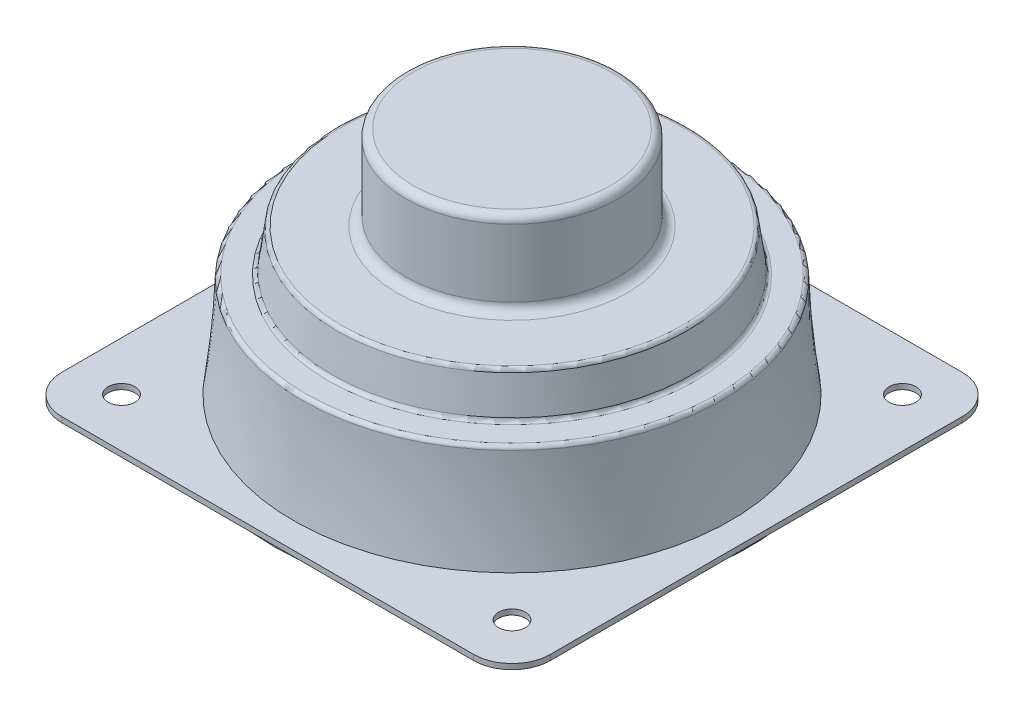
ISO-10303-21;
HEADER;
FILE_DESCRIPTION(('STEP AP214'),'2;1');
FILE_NAME('part.step','',(''),(''),'','','');
FILE_SCHEMA(('AUTOMOTIVE_DESIGN { 1 0 10303 214 1 1 1 1 }'));
ENDSEC;
DATA;
#1=APPLICATION_CONTEXT('core data for automotive mechanical design processes');
#2=APPLICATION_PROTOCOL_DEFINITION('international standard','automotive_design',2000,#1);
#3=PRODUCT_CONTEXT('',#1,'mechanical');
#4=PRODUCT('Part','Part','',(#3));
#5=PRODUCT_RELATED_PRODUCT_CATEGORY('part','',(#4));
#6=PRODUCT_DEFINITION_FORMATION('','',#4);
#7=PRODUCT_DEFINITION_CONTEXT('part definition',#1,'design');
#8=PRODUCT_DEFINITION('design','',#6,#7);
#9=PRODUCT_DEFINITION_SHAPE('','',#8);
#10=(LENGTH_UNIT() NAMED_UNIT(*) SI_UNIT(.MILLI.,.METRE.));
#11=(NAMED_UNIT(*) PLANE_ANGLE_UNIT() SI_UNIT($,.RADIAN.));
#12=(NAMED_UNIT(*) SI_UNIT($,.STERADIAN.) SOLID_ANGLE_UNIT());
#13=UNCERTAINTY_MEASURE_WITH_UNIT(LENGTH_MEASURE(1.E-05),#10,'distance_accuracy_value','');
#14=(GEOMETRIC_REPRESENTATION_CONTEXT(3) GLOBAL_UNCERTAINTY_ASSIGNED_CONTEXT((#13)) GLOBAL_UNIT_ASSIGNED_CONTEXT((#10,
#11,#12)) REPRESENTATION_CONTEXT('',''));
#15=CARTESIAN_POINT('',(0.,0.,0.));
#16=DIRECTION('',(0.,0.,1.));
#17=DIRECTION('',(1.,0.,0.));
#18=AXIS2_PLACEMENT_3D('',#15,#16,#17);
#19=CARTESIAN_POINT('',(0.,19.7,0.));
#20=DIRECTION('',(0.,1.,0.));
#21=DIRECTION('',(0.,0.,1.));
#22=AXIS2_PLACEMENT_3D('',#19,#20,#21);
#23=PLANE('',#22);
#24=CARTESIAN_POINT('',(0.,19.7,0.));
#25=DIRECTION('',(0.,1.,0.));
#26=DIRECTION('',(0.,0.,1.));
#27=AXIS2_PLACEMENT_3D('',#24,#25,#26);
#28=CIRCLE('',#27,22.3135544702006);
#29=CARTESIAN_POINT('',(0.,19.7,22.3135544702006));
#30=VERTEX_POINT('',#29);
#31=EDGE_CURVE('E12',#30,#30,#28,.T.);
#32=ORIENTED_EDGE('',*,*,#31,.T.);
#33=EDGE_LOOP('',(#32));
#34=FACE_BOUND('',#33,.T.);
#35=CARTESIAN_POINT('',(0.,19.7,0.));
#36=DIRECTION('',(0.,1.,0.));
#37=DIRECTION('',(0.,0.,1.));
#38=AXIS2_PLACEMENT_3D('',#35,#36,#37);
#39=CIRCLE('',#38,15.05);
#40=CARTESIAN_POINT('',(0.,19.7,15.05));
#41=VERTEX_POINT('',#40);
#42=EDGE_CURVE('E177',#41,#41,#39,.F.);
#43=ORIENTED_EDGE('',*,*,#42,.T.);
#44=EDGE_LOOP('',(#43));
#45=FACE_BOUND('',#44,.T.);
#46=ADVANCED_FACE('F39',(#34,#45),#23,.T.);
#47=CARTESIAN_POINT('',(0.,14.2,0.));
#48=DIRECTION('',(0.,1.,0.));
#49=DIRECTION('',(0.,0.,1.));
#50=AXIS2_PLACEMENT_3D('',#47,#48,#49);
#51=PLANE('',#50);
#52=CARTESIAN_POINT('',(0.,14.2,0.));
#53=DIRECTION('',(0.,1.,0.));
#54=DIRECTION('',(0.,0.,1.));
#55=AXIS2_PLACEMENT_3D('',#52,#53,#54);
#56=CIRCLE('',#55,26.8641485849492);
#57=CARTESIAN_POINT('',(0.,14.2,26.8641485849492));
#58=VERTEX_POINT('',#57);
#59=EDGE_CURVE('E183',#58,#58,#56,.T.);
#60=ORIENTED_EDGE('',*,*,#59,.T.);
#61=EDGE_LOOP('',(#60));
#62=FACE_BOUND('',#61,.T.);
#63=CARTESIAN_POINT('',(0.,14.2,0.));
#64=DIRECTION('',(0.,1.,0.));
#65=DIRECTION('',(0.,0.,1.));
#66=AXIS2_PLACEMENT_3D('',#63,#64,#65);
#67=CIRCLE('',#66,23.9364455297994);
#68=CARTESIAN_POINT('',(0.,14.2,23.9364455297994));
#69=VERTEX_POINT('',#68);
#70=EDGE_CURVE('E180',#69,#69,#67,.F.);
#71=ORIENTED_EDGE('',*,*,#70,.T.);
#72=EDGE_LOOP('',(#71));
#73=FACE_BOUND('',#72,.T.);
#74=ADVANCED_FACE('F211',(#62,#73),#51,.T.);
#75=CARTESIAN_POINT('',(0.,-1.,0.));
#76=DIRECTION('',(0.,-1.,0.));
#77=DIRECTION('',(0.,0.,-1.));
#78=AXIS2_PLACEMENT_3D('',#75,#76,#77);
#79=PLANE('',#78);
#80=CARTESIAN_POINT('',(0.,-1.,0.));
#81=DIRECTION('',(0.,-1.,0.));
#82=DIRECTION('',(0.,0.,-1.));
#83=AXIS2_PLACEMENT_3D('',#80,#81,#82);
#84=CIRCLE('',#83,31.);
#85=CARTESIAN_POINT('',(0.,-1.,-31.));
#86=VERTEX_POINT('',#85);
#87=EDGE_CURVE('E528',#86,#86,#84,.T.);
#88=ORIENTED_EDGE('',*,*,#87,.T.);
#89=EDGE_LOOP('',(#88));
#90=FACE_BOUND('',#89,.T.);
#91=CARTESIAN_POINT('',(0.,-1.,0.));
#92=DIRECTION('',(0.,-1.,0.));
#93=DIRECTION('',(0.,0.,-1.));
#94=AXIS2_PLACEMENT_3D('',#91,#92,#93);
#95=CIRCLE('',#94,25.2);
#96=CARTESIAN_POINT('',(0.,-1.,-25.2));
#97=VERTEX_POINT('',#96);
#98=EDGE_CURVE('E537',#97,#97,#95,.T.);
#99=ORIENTED_EDGE('',*,*,#98,.F.);
#100=EDGE_LOOP('',(#99));
#101=FACE_BOUND('',#100,.T.);
#102=ADVANCED_FACE('F217',(#90,#101),#79,.T.);
#103=CARTESIAN_POINT('',(-26.85,0.,26.85));
#104=DIRECTION('',(0.,-1.,0.));
#105=DIRECTION('',(0.,0.,-1.));
#106=AXIS2_PLACEMENT_3D('',#103,#104,#105);
#107=PLANE('',#106);
#108=CARTESIAN_POINT('',(-25.4558441227157,0.,25.4558441227157));
#109=DIRECTION('',(0.,1.,0.));
#110=DIRECTION('',(0.,0.,1.));
#111=AXIS2_PLACEMENT_3D('',#108,#109,#110);
#112=CIRCLE('',#111,1.75);
#113=CARTESIAN_POINT('',(-25.4558441227157,0.,27.2058441227157));
#114=VERTEX_POINT('',#113);
#115=EDGE_CURVE('E525',#114,#114,#112,.T.);
#116=ORIENTED_EDGE('',*,*,#115,.T.);
#117=EDGE_LOOP('',(#116));
#118=FACE_BOUND('',#117,.T.);
#119=CARTESIAN_POINT('',(25.4558441227157,0.,25.4558441227157));
#120=DIRECTION('',(0.,1.,0.));
#121=DIRECTION('',(0.,0.,1.));
#122=AXIS2_PLACEMENT_3D('',#119,#120,#121);
#123=CIRCLE('',#122,1.75);
#124=CARTESIAN_POINT('',(25.4558441227157,0.,27.2058441227157));
#125=VERTEX_POINT('',#124);
#126=EDGE_CURVE('E513',#125,#125,#123,.T.);
#127=ORIENTED_EDGE('',*,*,#126,.T.);
#128=EDGE_LOOP('',(#127));
#129=FACE_BOUND('',#128,.T.);
#130=CARTESIAN_POINT('',(-26.85,0.,26.85));
#131=DIRECTION('',(0.,1.,0.));
#132=DIRECTION('',(0.,0.,-1.));
#133=AXIS2_PLACEMENT_3D('',#130,#131,#132);
#134=CIRCLE('',#133,5.);
#135=CARTESIAN_POINT('',(-31.85,0.,26.85));
#136=VERTEX_POINT('',#135);
#137=CARTESIAN_POINT('',(-26.85,0.,31.85));
#138=VERTEX_POINT('',#137);
#139=EDGE_CURVE('E138',#136,#138,#134,.T.);
#140=ORIENTED_EDGE('',*,*,#139,.F.);
#141=DIRECTION('',(0.,0.,1.));
#142=VECTOR('',#141,1.);
#143=CARTESIAN_POINT('',(-31.85,0.,26.85));
#144=LINE('',#143,#142);
#145=CARTESIAN_POINT('',(-31.85,0.,-26.85));
#146=VERTEX_POINT('',#145);
#147=EDGE_CURVE('E91',#146,#136,#144,.T.);
#148=ORIENTED_EDGE('',*,*,#147,.F.);
#149=CARTESIAN_POINT('',(-26.85,0.,-26.85));
#150=DIRECTION('',(0.,1.,0.));
#151=DIRECTION('',(0.,0.,1.));
#152=AXIS2_PLACEMENT_3D('',#149,#150,#151);
#153=CIRCLE('',#152,5.);
#154=CARTESIAN_POINT('',(-26.85,0.,-31.85));
#155=VERTEX_POINT('',#154);
#156=EDGE_CURVE('E85',#155,#146,#153,.T.);
#157=ORIENTED_EDGE('',*,*,#156,.F.);
#158=DIRECTION('',(-1.,0.,0.));
#159=VECTOR('',#158,1.);
#160=CARTESIAN_POINT('',(26.85,0.,-31.85));
#161=LINE('',#160,#159);
#162=CARTESIAN_POINT('',(26.85,0.,-31.85));
#163=VERTEX_POINT('',#162);
#164=EDGE_CURVE('E128',#163,#155,#161,.T.);
#165=ORIENTED_EDGE('',*,*,#164,.F.);
#166=CARTESIAN_POINT('',(26.85,0.,-26.85));
#167=DIRECTION('',(0.,1.,0.));
#168=DIRECTION('',(0.,0.,1.));
#169=AXIS2_PLACEMENT_3D('',#166,#167,#168);
#170=CIRCLE('',#169,5.);
#171=CARTESIAN_POINT('',(31.85,0.,-26.85));
#172=VERTEX_POINT('',#171);
#173=EDGE_CURVE('E148',#172,#163,#170,.T.);
#174=ORIENTED_EDGE('',*,*,#173,.F.);
#175=DIRECTION('',(0.,0.,-1.));
#176=VECTOR('',#175,1.);
#177=CARTESIAN_POINT('',(31.85,0.,26.85));
#178=LINE('',#177,#176);
#179=CARTESIAN_POINT('',(31.85,0.,26.85));
#180=VERTEX_POINT('',#179);
#181=EDGE_CURVE('E146',#180,#172,#178,.T.);
#182=ORIENTED_EDGE('',*,*,#181,.F.);
#183=CARTESIAN_POINT('',(26.85,0.,26.85));
#184=DIRECTION('',(0.,1.,0.));
#185=DIRECTION('',(0.,0.,1.));
#186=AXIS2_PLACEMENT_3D('',#183,#184,#185);
#187=CIRCLE('',#186,5.);
#188=CARTESIAN_POINT('',(26.85,0.,31.85));
#189=VERTEX_POINT('',#188);
#190=EDGE_CURVE('E144',#189,#180,#187,.T.);
#191=ORIENTED_EDGE('',*,*,#190,.F.);
#192=DIRECTION('',(1.,0.,0.));
#193=VECTOR('',#192,1.);
#194=CARTESIAN_POINT('',(26.85,0.,31.85));
#195=LINE('',#194,#193);
#196=EDGE_CURVE('E141',#138,#189,#195,.T.);
#197=ORIENTED_EDGE('',*,*,#196,.F.);
#198=EDGE_LOOP('',(#140,#148,#157,#165,#174,#182,#191,#197));
#199=FACE_BOUND('',#198,.T.);
#200=CARTESIAN_POINT('',(-25.4558441227157,0.,-25.4558441227157));
#201=DIRECTION('',(0.,1.,0.));
#202=DIRECTION('',(0.,0.,1.));
#203=AXIS2_PLACEMENT_3D('',#200,#201,#202);
#204=CIRCLE('',#203,1.75);
#205=CARTESIAN_POINT('',(-25.4558441227157,0.,-23.7058441227157));
#206=VERTEX_POINT('',#205);
#207=EDGE_CURVE('E507',#206,#206,#204,.T.);
#208=ORIENTED_EDGE('',*,*,#207,.T.);
#209=EDGE_LOOP('',(#208));
#210=FACE_BOUND('',#209,.T.);
#211=CARTESIAN_POINT('',(25.4558441227157,0.,-25.4558441227157));
#212=DIRECTION('',(0.,1.,0.));
#213=DIRECTION('',(0.,0.,1.));
#214=AXIS2_PLACEMENT_3D('',#211,#212,#213);
#215=CIRCLE('',#214,1.75);
#216=CARTESIAN_POINT('',(25.4558441227157,0.,-23.7058441227157));
#217=VERTEX_POINT('',#216);
#218=EDGE_CURVE('E519',#217,#217,#215,.T.);
#219=ORIENTED_EDGE('',*,*,#218,.T.);
#220=EDGE_LOOP('',(#219));
#221=FACE_BOUND('',#220,.T.);
#222=CARTESIAN_POINT('',(0.,0.,0.));
#223=DIRECTION('',(0.,-1.,0.));
#224=DIRECTION('',(0.,0.,-1.));
#225=AXIS2_PLACEMENT_3D('',#222,#223,#224);
#226=CIRCLE('',#225,31.);
#227=CARTESIAN_POINT('',(0.,0.,-31.));
#228=VERTEX_POINT('',#227);
#229=EDGE_CURVE('E531',#228,#228,#226,.T.);
#230=ORIENTED_EDGE('',*,*,#229,.F.);
#231=EDGE_LOOP('',(#230));
#232=FACE_BOUND('',#231,.T.);
#233=ADVANCED_FACE('F246',(#118,#129,#199,#210,#221,#232),#107,.T.);
#234=CARTESIAN_POINT('',(-26.85,0.7,26.85));
#235=DIRECTION('',(0.,-1.,0.));
#236=DIRECTION('',(0.,0.,-1.));
#237=AXIS2_PLACEMENT_3D('',#234,#235,#236);
#238=PLANE('',#237);
#239=CARTESIAN_POINT('',(0.,0.7,0.));
#240=DIRECTION('',(0.,1.,0.));
#241=DIRECTION('',(0.,0.,1.));
#242=AXIS2_PLACEMENT_3D('',#239,#240,#241);
#243=CIRCLE('',#242,28.5);
#244=CARTESIAN_POINT('',(-9.77187594911808,0.7,26.7723820463374));
#245=VERTEX_POINT('',#244);
#246=EDGE_CURVE('E540',#245,#245,#243,.T.);
#247=ORIENTED_EDGE('',*,*,#246,.F.);
#248=EDGE_LOOP('',(#247));
#249=FACE_BOUND('',#248,.T.);
#250=CARTESIAN_POINT('',(25.4558441227157,0.7,-25.4558441227157));
#251=DIRECTION('',(0.,1.,0.));
#252=DIRECTION('',(0.,0.,1.));
#253=AXIS2_PLACEMENT_3D('',#250,#251,#252);
#254=CIRCLE('',#253,1.75);
#255=CARTESIAN_POINT('',(25.4558441227157,0.7,-23.7058441227157));
#256=VERTEX_POINT('',#255);
#257=EDGE_CURVE('E516',#256,#256,#254,.T.);
#258=ORIENTED_EDGE('',*,*,#257,.F.);
#259=EDGE_LOOP('',(#258));
#260=FACE_BOUND('',#259,.T.);
#261=CARTESIAN_POINT('',(-25.4558441227157,0.7,-25.4558441227157));
#262=DIRECTION('',(0.,1.,0.));
#263=DIRECTION('',(0.,0.,1.));
#264=AXIS2_PLACEMENT_3D('',#261,#262,#263);
#265=CIRCLE('',#264,1.75);
#266=CARTESIAN_POINT('',(-25.4558441227157,0.7,-23.7058441227157));
#267=VERTEX_POINT('',#266);
#268=EDGE_CURVE('E142',#267,#267,#265,.T.);
#269=ORIENTED_EDGE('',*,*,#268,.F.);
#270=EDGE_LOOP('',(#269));
#271=FACE_BOUND('',#270,.T.);
#272=CARTESIAN_POINT('',(-26.85,0.7,26.85));
#273=DIRECTION('',(0.,1.,0.));
#274=DIRECTION('',(0.,0.,-1.));
#275=AXIS2_PLACEMENT_3D('',#272,#273,#274);
#276=CIRCLE('',#275,5.);
#277=CARTESIAN_POINT('',(-31.85,0.7,26.85));
#278=VERTEX_POINT('',#277);
#279=CARTESIAN_POINT('',(-26.85,0.7,31.85));
#280=VERTEX_POINT('',#279);
#281=EDGE_CURVE('E153',#278,#280,#276,.T.);
#282=ORIENTED_EDGE('',*,*,#281,.T.);
#283=DIRECTION('',(1.,0.,0.));
#284=VECTOR('',#283,1.);
#285=CARTESIAN_POINT('',(26.85,0.7,31.85));
#286=LINE('',#285,#284);
#287=CARTESIAN_POINT('',(26.85,0.7,31.85));
#288=VERTEX_POINT('',#287);
#289=EDGE_CURVE('E100',#280,#288,#286,.T.);
#290=ORIENTED_EDGE('',*,*,#289,.T.);
#291=CARTESIAN_POINT('',(26.85,0.7,26.85));
#292=DIRECTION('',(0.,1.,0.));
#293=DIRECTION('',(0.,0.,1.));
#294=AXIS2_PLACEMENT_3D('',#291,#292,#293);
#295=CIRCLE('',#294,5.);
#296=CARTESIAN_POINT('',(31.85,0.7,26.85));
#297=VERTEX_POINT('',#296);
#298=EDGE_CURVE('E499',#288,#297,#295,.T.);
#299=ORIENTED_EDGE('',*,*,#298,.T.);
#300=DIRECTION('',(0.,0.,-1.));
#301=VECTOR('',#300,1.);
#302=CARTESIAN_POINT('',(31.85,0.7,26.85));
#303=LINE('',#302,#301);
#304=CARTESIAN_POINT('',(31.85,0.7,-26.85));
#305=VERTEX_POINT('',#304);
#306=EDGE_CURVE('E501',#297,#305,#303,.T.);
#307=ORIENTED_EDGE('',*,*,#306,.T.);
#308=CARTESIAN_POINT('',(26.85,0.7,-26.85));
#309=DIRECTION('',(0.,1.,0.));
#310=DIRECTION('',(0.,0.,1.));
#311=AXIS2_PLACEMENT_3D('',#308,#309,#310);
#312=CIRCLE('',#311,5.);
#313=CARTESIAN_POINT('',(26.85,0.7,-31.85));
#314=VERTEX_POINT('',#313);
#315=EDGE_CURVE('E120',#305,#314,#312,.T.);
#316=ORIENTED_EDGE('',*,*,#315,.T.);
#317=DIRECTION('',(-1.,0.,0.));
#318=VECTOR('',#317,1.);
#319=CARTESIAN_POINT('',(26.85,0.7,-31.85));
#320=LINE('',#319,#318);
#321=CARTESIAN_POINT('',(-26.85,0.7,-31.85));
#322=VERTEX_POINT('',#321);
#323=EDGE_CURVE('E113',#314,#322,#320,.T.);
#324=ORIENTED_EDGE('',*,*,#323,.T.);
#325=CARTESIAN_POINT('',(-26.85,0.7,-26.85));
#326=DIRECTION('',(0.,1.,0.));
#327=DIRECTION('',(0.,0.,1.));
#328=AXIS2_PLACEMENT_3D('',#325,#326,#327);
#329=CIRCLE('',#328,5.);
#330=CARTESIAN_POINT('',(-31.85,0.7,-26.85));
#331=VERTEX_POINT('',#330);
#332=EDGE_CURVE('E118',#322,#331,#329,.T.);
#333=ORIENTED_EDGE('',*,*,#332,.T.);
#334=DIRECTION('',(0.,0.,1.));
#335=VECTOR('',#334,1.);
#336=CARTESIAN_POINT('',(-31.85,0.7,26.85));
#337=LINE('',#336,#335);
#338=EDGE_CURVE('E56',#331,#278,#337,.T.);
#339=ORIENTED_EDGE('',*,*,#338,.T.);
#340=EDGE_LOOP('',(#282,#290,#299,#307,#316,#324,#333,#339));
#341=FACE_BOUND('',#340,.T.);
#342=CARTESIAN_POINT('',(25.4558441227157,0.7,25.4558441227157));
#343=DIRECTION('',(0.,1.,0.));
#344=DIRECTION('',(0.,0.,1.));
#345=AXIS2_PLACEMENT_3D('',#342,#343,#344);
#346=CIRCLE('',#345,1.75);
#347=CARTESIAN_POINT('',(25.4558441227157,0.7,27.2058441227157));
#348=VERTEX_POINT('',#347);
#349=EDGE_CURVE('E510',#348,#348,#346,.T.);
#350=ORIENTED_EDGE('',*,*,#349,.F.);
#351=EDGE_LOOP('',(#350));
#352=FACE_BOUND('',#351,.T.);
#353=CARTESIAN_POINT('',(-25.4558441227157,0.7,25.4558441227157));
#354=DIRECTION('',(0.,1.,0.));
#355=DIRECTION('',(0.,0.,1.));
#356=AXIS2_PLACEMENT_3D('',#353,#354,#355);
#357=CIRCLE('',#356,1.75);
#358=CARTESIAN_POINT('',(-25.4558441227157,0.7,27.2058441227157));
#359=VERTEX_POINT('',#358);
#360=EDGE_CURVE('E522',#359,#359,#357,.T.);
#361=ORIENTED_EDGE('',*,*,#360,.F.);
#362=EDGE_LOOP('',(#361));
#363=FACE_BOUND('',#362,.T.);
#364=ADVANCED_FACE('F115',(#249,#260,#271,#341,#352,#363),#238,.F.);
#365=CARTESIAN_POINT('',(-26.85,0.7,26.85));
#366=DIRECTION('',(0.,-1.,0.));
#367=DIRECTION('',(0.,0.,-1.));
#368=AXIS2_PLACEMENT_3D('',#365,#366,#367);
#369=CYLINDRICAL_SURFACE('',#368,5.);
#370=ORIENTED_EDGE('',*,*,#139,.T.);
#371=DIRECTION('',(0.,-1.,0.));
#372=VECTOR('',#371,1.);
#373=CARTESIAN_POINT('',(-26.85,0.7,31.85));
#374=LINE('',#373,#372);
#375=EDGE_CURVE('E166',#280,#138,#374,.T.);
#376=ORIENTED_EDGE('',*,*,#375,.F.);
#377=ORIENTED_EDGE('',*,*,#281,.F.);
#378=DIRECTION('',(0.,-1.,0.));
#379=VECTOR('',#378,1.);
#380=CARTESIAN_POINT('',(-31.85,0.7,26.85));
#381=LINE('',#380,#379);
#382=EDGE_CURVE('E134',#278,#136,#381,.T.);
#383=ORIENTED_EDGE('',*,*,#382,.T.);
#384=EDGE_LOOP('',(#370,#376,#377,#383));
#385=FACE_BOUND('',#384,.T.);
#386=ADVANCED_FACE('F270',(#385),#369,.T.);
#387=CARTESIAN_POINT('',(26.85,0.7,31.85));
#388=DIRECTION('',(0.,0.,-1.));
#389=DIRECTION('',(-1.,0.,0.));
#390=AXIS2_PLACEMENT_3D('',#387,#388,#389);
#391=PLANE('',#390);
#392=ORIENTED_EDGE('',*,*,#196,.T.);
#393=DIRECTION('',(0.,-1.,0.));
#394=VECTOR('',#393,1.);
#395=CARTESIAN_POINT('',(26.85,0.7,31.85));
#396=LINE('',#395,#394);
#397=EDGE_CURVE('E163',#288,#189,#396,.T.);
#398=ORIENTED_EDGE('',*,*,#397,.F.);
#399=ORIENTED_EDGE('',*,*,#289,.F.);
#400=ORIENTED_EDGE('',*,*,#375,.T.);
#401=EDGE_LOOP('',(#392,#398,#399,#400));
#402=FACE_BOUND('',#401,.T.);
#403=ADVANCED_FACE('F292',(#402),#391,.F.);
#404=CARTESIAN_POINT('',(26.85,0.7,26.85));
#405=DIRECTION('',(0.,-1.,0.));
#406=DIRECTION('',(0.,0.,-1.));
#407=AXIS2_PLACEMENT_3D('',#404,#405,#406);
#408=CYLINDRICAL_SURFACE('',#407,5.);
#409=ORIENTED_EDGE('',*,*,#190,.T.);
#410=DIRECTION('',(0.,-1.,0.));
#411=VECTOR('',#410,1.);
#412=CARTESIAN_POINT('',(31.85,0.7,26.85));
#413=LINE('',#412,#411);
#414=EDGE_CURVE('E160',#297,#180,#413,.T.);
#415=ORIENTED_EDGE('',*,*,#414,.F.);
#416=ORIENTED_EDGE('',*,*,#298,.F.);
#417=ORIENTED_EDGE('',*,*,#397,.T.);
#418=EDGE_LOOP('',(#409,#415,#416,#417));
#419=FACE_BOUND('',#418,.T.);
#420=ADVANCED_FACE('F288',(#419),#408,.T.);
#421=CARTESIAN_POINT('',(31.85,0.7,26.85));
#422=DIRECTION('',(-1.,0.,0.));
#423=DIRECTION('',(0.,0.,1.));
#424=AXIS2_PLACEMENT_3D('',#421,#422,#423);
#425=PLANE('',#424);
#426=ORIENTED_EDGE('',*,*,#181,.T.);
#427=DIRECTION('',(0.,-1.,0.));
#428=VECTOR('',#427,1.);
#429=CARTESIAN_POINT('',(31.85,0.7,-26.85));
#430=LINE('',#429,#428);
#431=EDGE_CURVE('E157',#305,#172,#430,.T.);
#432=ORIENTED_EDGE('',*,*,#431,.F.);
#433=ORIENTED_EDGE('',*,*,#306,.F.);
#434=ORIENTED_EDGE('',*,*,#414,.T.);
#435=EDGE_LOOP('',(#426,#432,#433,#434));
#436=FACE_BOUND('',#435,.T.);
#437=ADVANCED_FACE('F284',(#436),#425,.F.);
#438=CARTESIAN_POINT('',(26.85,0.7,-26.85));
#439=DIRECTION('',(0.,-1.,0.));
#440=DIRECTION('',(0.,0.,-1.));
#441=AXIS2_PLACEMENT_3D('',#438,#439,#440);
#442=CYLINDRICAL_SURFACE('',#441,5.);
#443=ORIENTED_EDGE('',*,*,#173,.T.);
#444=DIRECTION('',(0.,-1.,0.));
#445=VECTOR('',#444,1.);
#446=CARTESIAN_POINT('',(26.85,0.7,-31.85));
#447=LINE('',#446,#445);
#448=EDGE_CURVE('E129',#314,#163,#447,.T.);
#449=ORIENTED_EDGE('',*,*,#448,.F.);
#450=ORIENTED_EDGE('',*,*,#315,.F.);
#451=ORIENTED_EDGE('',*,*,#431,.T.);
#452=EDGE_LOOP('',(#443,#449,#450,#451));
#453=FACE_BOUND('',#452,.T.);
#454=ADVANCED_FACE('F281',(#453),#442,.T.);
#455=CARTESIAN_POINT('',(26.85,0.7,-31.85));
#456=DIRECTION('',(0.,0.,1.));
#457=DIRECTION('',(1.,0.,0.));
#458=AXIS2_PLACEMENT_3D('',#455,#456,#457);
#459=PLANE('',#458);
#460=ORIENTED_EDGE('',*,*,#164,.T.);
#461=DIRECTION('',(0.,-1.,0.));
#462=VECTOR('',#461,1.);
#463=CARTESIAN_POINT('',(-26.85,0.7,-31.85));
#464=LINE('',#463,#462);
#465=EDGE_CURVE('E125',#322,#155,#464,.T.);
#466=ORIENTED_EDGE('',*,*,#465,.F.);
#467=ORIENTED_EDGE('',*,*,#323,.F.);
#468=ORIENTED_EDGE('',*,*,#448,.T.);
#469=EDGE_LOOP('',(#460,#466,#467,#468));
#470=FACE_BOUND('',#469,.T.);
#471=ADVANCED_FACE('F126',(#470),#459,.F.);
#472=CARTESIAN_POINT('',(-26.85,0.7,-26.85));
#473=DIRECTION('',(0.,-1.,0.));
#474=DIRECTION('',(0.,0.,-1.));
#475=AXIS2_PLACEMENT_3D('',#472,#473,#474);
#476=CYLINDRICAL_SURFACE('',#475,5.);
#477=ORIENTED_EDGE('',*,*,#156,.T.);
#478=DIRECTION('',(0.,-1.,0.));
#479=VECTOR('',#478,1.);
#480=CARTESIAN_POINT('',(-31.85,0.7,-26.85));
#481=LINE('',#480,#479);
#482=EDGE_CURVE('E130',#331,#146,#481,.T.);
#483=ORIENTED_EDGE('',*,*,#482,.F.);
#484=ORIENTED_EDGE('',*,*,#332,.F.);
#485=ORIENTED_EDGE('',*,*,#465,.T.);
#486=EDGE_LOOP('',(#477,#483,#484,#485));
#487=FACE_BOUND('',#486,.T.);
#488=ADVANCED_FACE('F132',(#487),#476,.T.);
#489=CARTESIAN_POINT('',(-31.85,0.7,26.85));
#490=DIRECTION('',(1.,0.,0.));
#491=DIRECTION('',(0.,0.,-1.));
#492=AXIS2_PLACEMENT_3D('',#489,#490,#491);
#493=PLANE('',#492);
#494=ORIENTED_EDGE('',*,*,#147,.T.);
#495=ORIENTED_EDGE('',*,*,#382,.F.);
#496=ORIENTED_EDGE('',*,*,#338,.F.);
#497=ORIENTED_EDGE('',*,*,#482,.T.);
#498=EDGE_LOOP('',(#494,#495,#496,#497));
#499=FACE_BOUND('',#498,.T.);
#500=ADVANCED_FACE('F266',(#499),#493,.F.);
#501=CARTESIAN_POINT('',(-25.4558441227157,0.7,-25.4558441227157));
#502=DIRECTION('',(0.,-1.,0.));
#503=DIRECTION('',(0.,0.,-1.));
#504=AXIS2_PLACEMENT_3D('',#501,#502,#503);
#505=CYLINDRICAL_SURFACE('',#504,1.75);
#506=ORIENTED_EDGE('',*,*,#268,.T.);
#507=EDGE_LOOP('',(#506));
#508=FACE_BOUND('',#507,.T.);
#509=ORIENTED_EDGE('',*,*,#207,.F.);
#510=EDGE_LOOP('',(#509));
#511=FACE_BOUND('',#510,.T.);
#512=ADVANCED_FACE('F262',(#508,#511),#505,.F.);
#513=CARTESIAN_POINT('',(25.4558441227157,0.7,25.4558441227157));
#514=DIRECTION('',(0.,-1.,0.));
#515=DIRECTION('',(0.,0.,-1.));
#516=AXIS2_PLACEMENT_3D('',#513,#514,#515);
#517=CYLINDRICAL_SURFACE('',#516,1.75);
#518=ORIENTED_EDGE('',*,*,#349,.T.);
#519=EDGE_LOOP('',(#518));
#520=FACE_BOUND('',#519,.T.);
#521=ORIENTED_EDGE('',*,*,#126,.F.);
#522=EDGE_LOOP('',(#521));
#523=FACE_BOUND('',#522,.T.);
#524=ADVANCED_FACE('F258',(#520,#523),#517,.F.);
#525=CARTESIAN_POINT('',(25.4558441227157,0.7,-25.4558441227157));
#526=DIRECTION('',(0.,-1.,0.));
#527=DIRECTION('',(0.,0.,-1.));
#528=AXIS2_PLACEMENT_3D('',#525,#526,#527);
#529=CYLINDRICAL_SURFACE('',#528,1.75);
#530=ORIENTED_EDGE('',*,*,#257,.T.);
#531=EDGE_LOOP('',(#530));
#532=FACE_BOUND('',#531,.T.);
#533=ORIENTED_EDGE('',*,*,#218,.F.);
#534=EDGE_LOOP('',(#533));
#535=FACE_BOUND('',#534,.T.);
#536=ADVANCED_FACE('F254',(#532,#535),#529,.F.);
#537=CARTESIAN_POINT('',(-25.4558441227157,0.7,25.4558441227157));
#538=DIRECTION('',(0.,-1.,0.));
#539=DIRECTION('',(0.,0.,-1.));
#540=AXIS2_PLACEMENT_3D('',#537,#538,#539);
#541=CYLINDRICAL_SURFACE('',#540,1.75);
#542=ORIENTED_EDGE('',*,*,#360,.T.);
#543=EDGE_LOOP('',(#542));
#544=FACE_BOUND('',#543,.T.);
#545=ORIENTED_EDGE('',*,*,#115,.F.);
#546=EDGE_LOOP('',(#545));
#547=FACE_BOUND('',#546,.T.);
#548=ADVANCED_FACE('F250',(#544,#547),#541,.F.);
#549=CARTESIAN_POINT('',(0.,-1.,0.));
#550=DIRECTION('',(0.,1.,0.));
#551=DIRECTION('',(0.,0.,1.));
#552=AXIS2_PLACEMENT_3D('',#549,#550,#551);
#553=CYLINDRICAL_SURFACE('',#552,31.);
#554=ORIENTED_EDGE('',*,*,#87,.F.);
#555=EDGE_LOOP('',(#554));
#556=FACE_BOUND('',#555,.T.);
#557=ORIENTED_EDGE('',*,*,#229,.T.);
#558=EDGE_LOOP('',(#557));
#559=FACE_BOUND('',#558,.T.);
#560=ADVANCED_FACE('F242',(#556,#559),#553,.T.);
#561=CARTESIAN_POINT('',(0.,-3.,0.));
#562=DIRECTION('',(0.,1.,0.));
#563=DIRECTION('',(0.,0.,1.));
#564=AXIS2_PLACEMENT_3D('',#561,#562,#563);
#565=CYLINDRICAL_SURFACE('',#564,25.2);
#566=CARTESIAN_POINT('',(0.,-3.,0.));
#567=DIRECTION('',(0.,-1.,0.));
#568=DIRECTION('',(0.,0.,-1.));
#569=AXIS2_PLACEMENT_3D('',#566,#567,#568);
#570=CIRCLE('',#569,25.2);
#571=CARTESIAN_POINT('',(0.,-3.,-25.2));
#572=VERTEX_POINT('',#571);
#573=EDGE_CURVE('E534',#572,#572,#570,.T.);
#574=ORIENTED_EDGE('',*,*,#573,.F.);
#575=EDGE_LOOP('',(#574));
#576=FACE_BOUND('',#575,.T.);
#577=ORIENTED_EDGE('',*,*,#98,.T.);
#578=EDGE_LOOP('',(#577));
#579=FACE_BOUND('',#578,.T.);
#580=ADVANCED_FACE('F238',(#576,#579),#565,.T.);
#581=CARTESIAN_POINT('',(0.,-3.,0.));
#582=DIRECTION('',(0.,-1.,0.));
#583=DIRECTION('',(0.,0.,-1.));
#584=AXIS2_PLACEMENT_3D('',#581,#582,#583);
#585=PLANE('',#584);
#586=ORIENTED_EDGE('',*,*,#573,.T.);
#587=EDGE_LOOP('',(#586));
#588=FACE_BOUND('',#587,.T.);
#589=ADVANCED_FACE('F228',(#588),#585,.T.);
#590=CARTESIAN_POINT('',(-9.77187594911808,0.7,26.7723820463374));
#591=CARTESIAN_POINT('',(-3.10369624119678,14.2,27.1733245967876));
#592=CARTESIAN_POINT('',(43.7728881435567,0.7,46.3161339445735));
#593=CARTESIAN_POINT('',(51.2429529523783,14.2,33.3807170791811));
#594=CARTESIAN_POINT('',(63.3166400417928,0.7,-7.22863014810123));
#595=CARTESIAN_POINT('',(57.4503454347719,14.2,-20.965932114394));
#596=CARTESIAN_POINT('',(9.77187594911807,0.7,-26.7723820463374));
#597=CARTESIAN_POINT('',(3.1036962411968,14.2,-27.1733245967876));
#598=CARTESIAN_POINT('',(-43.7728881435567,0.7,-46.3161339445735));
#599=CARTESIAN_POINT('',(-51.2429529523784,14.2,-33.3807170791812));
#600=CARTESIAN_POINT('',(-63.3166400417928,0.7,7.22863014810123));
#601=CARTESIAN_POINT('',(-57.450345434772,14.2,20.965932114394));
#602=CARTESIAN_POINT('',(-9.77187594911808,0.7,26.7723820463374));
#603=CARTESIAN_POINT('',(-3.10369624119678,14.2,27.1733245967876));
#604=(BOUNDED_SURFACE() B_SPLINE_SURFACE(3,1,((#590,#591),(#592,#593),(#594,#595),(#596,#597),
(#598,#599),(#600,#601),(#602,#603)),.UNSPECIFIED.,.T.,.F.,.F.) B_SPLINE_SURFACE_WITH_KNOTS((4,
3,4),(2,2),(0.,0.5,1.),(0.,1.),
.UNSPECIFIED.) GEOMETRIC_REPRESENTATION_ITEM() RATIONAL_B_SPLINE_SURFACE(((1.,1.),
(0.333333333333333,0.333333333333334),(0.333333333333333,0.333333333333334),(1.,1.),
(0.333333333333333,0.333333333333333),(0.333333333333333,0.333333333333333),(1.,1.))) REPRESENTATION_ITEM('') SURFACE());
#605=CARTESIAN_POINT('',(0.,13.7154264177727,0.));
#606=DIRECTION('',(0.,1.,0.));
#607=DIRECTION('',(0.,0.,1.));
#608=AXIS2_PLACEMENT_3D('',#605,#606,#607);
#609=CIRCLE('',#608,27.3639105539252);
#610=CARTESIAN_POINT('',(-3.34304614697479,13.7154264177727,27.1589330287921));
#611=VERTEX_POINT('',#610);
#612=EDGE_CURVE('E186',#611,#611,#609,.F.);
#613=CARTESIAN_POINT('',(-3.34304614697479,13.7154264177727,27.1589330287921));
#614=CARTESIAN_POINT('',(-3.41001312408045,13.5798490592542,27.1549064560582));
#615=CARTESIAN_POINT('',(-3.47698010118611,13.4442717007357,27.1508798833243));
#616=CARTESIAN_POINT('',(-3.61091405539743,13.1731169836988,27.1428267378565));
#617=CARTESIAN_POINT('',(-3.67788103250309,13.0375396251803,27.1388001651226));
#618=CARTESIAN_POINT('',(-3.81181498671441,12.7663849081434,27.1307470196548));
#619=CARTESIAN_POINT('',(-3.87878196382006,12.6308075496249,27.1267204469209));
#620=CARTESIAN_POINT('',(-4.01271591803138,12.359652832588,27.1186673014531));
#621=CARTESIAN_POINT('',(-4.07968289513704,12.2240754740695,27.1146407287192));
#622=CARTESIAN_POINT('',(-4.21361684934836,11.9529207570326,27.1065875832514));
#623=CARTESIAN_POINT('',(-4.28058382645402,11.8173433985141,27.1025610105175));
#624=CARTESIAN_POINT('',(-4.41451778066534,11.5461886814772,27.0945078650496));
#625=CARTESIAN_POINT('',(-4.481484757771,11.4106113229587,27.0904812923157));
#626=CARTESIAN_POINT('',(-4.61541871198232,11.1394566059218,27.0824281468479));
#627=CARTESIAN_POINT('',(-4.68238568908798,11.0038792474034,27.078401574114));
#628=CARTESIAN_POINT('',(-4.81631964329929,10.7327245303664,27.0703484286462));
#629=CARTESIAN_POINT('',(-4.88328662040495,10.597147171848,27.0663218559123));
#630=CARTESIAN_POINT('',(-5.01722057461627,10.325992454811,27.0582687104445));
#631=CARTESIAN_POINT('',(-5.08418755172193,10.1904150962926,27.0542421377106));
#632=CARTESIAN_POINT('',(-5.21812150593325,9.91926037925563,27.0461889922428));
#633=CARTESIAN_POINT('',(-5.28508848303891,9.78368302073716,27.0421624195089));
#634=CARTESIAN_POINT('',(-5.41902243725023,9.51252830370024,27.0341092740411));
#635=CARTESIAN_POINT('',(-5.48598941435589,9.37695094518177,27.0300827013072));
#636=CARTESIAN_POINT('',(-5.6199233685672,9.10579622814484,27.0220295558394));
#637=CARTESIAN_POINT('',(-5.68689034567286,8.97021886962638,27.0180029831055));
#638=CARTESIAN_POINT('',(-5.82082429988418,8.69906415258944,27.0099498376377));
#639=CARTESIAN_POINT('',(-5.88779127698984,8.56348679407098,27.0059232649038));
#640=CARTESIAN_POINT('',(-6.02172523120116,8.29233207703405,26.997870119436));
#641=CARTESIAN_POINT('',(-6.08869220830682,8.15675471851558,26.9938435467021));
#642=CARTESIAN_POINT('',(-6.22262616251814,7.88560000147865,26.9857904012343));
#643=CARTESIAN_POINT('',(-6.2895931396238,7.75002264296019,26.9817638285004));
#644=CARTESIAN_POINT('',(-6.42352709383511,7.47886792592326,26.9737106830325));
#645=CARTESIAN_POINT('',(-6.49049407094077,7.34329056740479,26.9696841102986));
#646=CARTESIAN_POINT('',(-6.62442802515209,7.07213585036786,26.9616309648308));
#647=CARTESIAN_POINT('',(-6.69139500225775,6.9365584918494,26.9576043920969));
#648=CARTESIAN_POINT('',(-6.82532895646907,6.66540377481247,26.9495512466291));
#649=CARTESIAN_POINT('',(-6.89229593357473,6.529826416294,26.9455246738952));
#650=CARTESIAN_POINT('',(-7.02622988778605,6.25867169925707,26.9374715284274));
#651=CARTESIAN_POINT('',(-7.09319686489171,6.12309434073861,26.9334449556935));
#652=CARTESIAN_POINT('',(-7.22713081910303,5.85193962370168,26.9253918102257));
#653=CARTESIAN_POINT('',(-7.29409779620868,5.71636226518321,26.9213652374918));
#654=CARTESIAN_POINT('',(-7.42803175042,5.44520754814628,26.913312092024));
#655=CARTESIAN_POINT('',(-7.49499872752566,5.30963018962782,26.9092855192901));
#656=CARTESIAN_POINT('',(-7.62893268173698,5.03847547259088,26.9012323738223));
#657=CARTESIAN_POINT('',(-7.69589965884264,4.90289811407242,26.8972058010884));
#658=CARTESIAN_POINT('',(-7.82983361305396,4.63174339703549,26.8891526556206));
#659=CARTESIAN_POINT('',(-7.89680059015962,4.49616603851702,26.8851260828867));
#660=CARTESIAN_POINT('',(-8.03073454437094,4.2250113214801,26.8770729374189));
#661=CARTESIAN_POINT('',(-8.0977015214766,4.08943396296163,26.873046364685));
#662=CARTESIAN_POINT('',(-8.23163547568791,3.8182792459247,26.8649932192172));
#663=CARTESIAN_POINT('',(-8.29860245279357,3.68270188740623,26.8609666464832));
#664=CARTESIAN_POINT('',(-8.43253640700489,3.4115471703693,26.8529135010154));
#665=CARTESIAN_POINT('',(-8.49950338411055,3.27596981185084,26.8488869282815));
#666=CARTESIAN_POINT('',(-8.63343733832187,3.00481509481391,26.8408337828137));
#667=CARTESIAN_POINT('',(-8.70040431542753,2.86923773629544,26.8368072100798));
#668=CARTESIAN_POINT('',(-8.83433826963885,2.59808301925851,26.828754064612));
#669=CARTESIAN_POINT('',(-8.90130524674451,2.46250566074005,26.8247274918781));
#670=CARTESIAN_POINT('',(-9.03523920095583,2.19135094370312,26.8166743464103));
#671=CARTESIAN_POINT('',(-9.10220617806148,2.05577358518465,26.8126477736764));
#672=CARTESIAN_POINT('',(-9.2361401322728,1.78461886814772,26.8045946282086));
#673=CARTESIAN_POINT('',(-9.30310710937846,1.64904150962926,26.8005680554747));
#674=CARTESIAN_POINT('',(-9.43704106358978,1.37788679259233,26.7925149100069));
#675=CARTESIAN_POINT('',(-9.50400804069544,1.24230943407386,26.788488337273));
#676=CARTESIAN_POINT('',(-9.63794199490676,0.971154717036931,26.7804351918052));
#677=CARTESIAN_POINT('',(-9.70490897201242,0.835577358518465,26.7764086190713));
#678=CARTESIAN_POINT('',(-9.77187594911808,0.7,26.7723820463374));
#679=B_SPLINE_CURVE_WITH_KNOTS('',3,(#613,#614,#615,#616,#617,#618,#619,#620,#621,#622,#623,
#624,#625,#626,#627,#628,#629,#630,#631,#632,#633,#634,#635,#636,#637,#638,#639,#640,#641,#642,
#643,#644,#645,#646,#647,#648,#649,#650,#651,#652,#653,#654,#655,#656,#657,#658,#659,#660,#661,
#662,#663,#664,#665,#666,#667,#668,#669,#670,#671,#672,#673,#674,#675,#676,#677,#678),
.UNSPECIFIED.,.F.,.F.,(4,2,2,2,2,2,2,2,2,2,2,2,2,2,2,2,2,2,2,2,2,2,2,2,2,2,2,2,2,2,2,2,4),(0.,
0.453804016158365,0.90760803231673,1.36141204847509,1.81521606463346,2.26902008079182,
2.72282409695019,3.17662811310855,3.63043212926692,4.08423614542528,4.53804016158365,
4.99184417774201,5.44564819390038,5.89945221005875,6.35325622621711,6.80706024237548,
7.26086425853384,7.71466827469221,8.16847229085057,8.62227630700893,9.0760803231673,
9.52988433932567,9.98368835548403,10.4374923716424,10.8912963878008,11.3451004039591,
11.7989044201175,12.2527084362759,12.7065124524342,13.1603164685926,13.614120484751,
14.0679245009093,14.5217285170677),.UNSPECIFIED.);
#680=EDGE_CURVE('BSEAM224',#611,#245,#679,.T.);
#681=ORIENTED_EDGE('',*,*,#612,.T.);
#682=ORIENTED_EDGE('',*,*,#246,.T.);
#683=ORIENTED_EDGE('',*,*,#680,.T.);
#684=ORIENTED_EDGE('',*,*,#680,.F.);
#685=EDGE_LOOP('',(#681,#683,#682,#684));
#686=FACE_BOUND('',#685,.T.);
#687=ADVANCED_FACE('F224',(#686),#604,.T.);
#688=CARTESIAN_POINT('',(0.,19.7,0.));
#689=DIRECTION('',(0.,-1.,0.));
#690=DIRECTION('',(0.,0.,-1.));
#691=AXIS2_PLACEMENT_3D('',#688,#689,#690);
#692=CONICAL_SURFACE('',#691,22.75,0.135527713985501);
#693=CARTESIAN_POINT('',(0.,14.6324433976333,0.));
#694=DIRECTION('',(0.,-1.,0.));
#695=DIRECTION('',(0.,0.,-1.));
#696=AXIS2_PLACEMENT_3D('',#693,#694,#695);
#697=CIRCLE('',#696,23.4410304457773);
#698=CARTESIAN_POINT('',(0.,14.6324433976333,-23.4410304457773));
#699=VERTEX_POINT('',#698);
#700=EDGE_CURVE('E48',#699,#699,#697,.F.);
#701=ORIENTED_EDGE('',*,*,#700,.T.);
#702=EDGE_LOOP('',(#701));
#703=FACE_BOUND('',#702,.T.);
#704=CARTESIAN_POINT('',(0.,19.2675566023666,0.));
#705=DIRECTION('',(0.,1.,0.));
#706=DIRECTION('',(0.,0.,1.));
#707=AXIS2_PLACEMENT_3D('',#704,#705,#706);
#708=CIRCLE('',#707,22.8089695542227);
#709=CARTESIAN_POINT('',(0.,19.2675566023666,22.8089695542227));
#710=VERTEX_POINT('',#709);
#711=EDGE_CURVE('E189',#710,#710,#708,.F.);
#712=ORIENTED_EDGE('',*,*,#711,.T.);
#713=EDGE_LOOP('',(#712));
#714=FACE_BOUND('',#713,.T.);
#715=ADVANCED_FACE('F194',(#703,#714),#692,.T.);
#716=CARTESIAN_POINT('',(0.,30.7,0.));
#717=DIRECTION('',(0.,-1.,0.));
#718=DIRECTION('',(0.,0.,-1.));
#719=AXIS2_PLACEMENT_3D('',#716,#717,#718);
#720=CYLINDRICAL_SURFACE('',#719,13.85);
#721=CARTESIAN_POINT('',(0.,20.9,0.));
#722=DIRECTION('',(0.,1.,0.));
#723=DIRECTION('',(0.,0.,1.));
#724=AXIS2_PLACEMENT_3D('',#721,#722,#723);
#725=CIRCLE('',#724,13.85);
#726=CARTESIAN_POINT('',(0.,20.9,13.85));
#727=VERTEX_POINT('',#726);
#728=EDGE_CURVE('E174',#727,#727,#725,.T.);
#729=ORIENTED_EDGE('',*,*,#728,.T.);
#730=EDGE_LOOP('',(#729));
#731=FACE_BOUND('',#730,.T.);
#732=CARTESIAN_POINT('',(0.,29.7,0.));
#733=DIRECTION('',(0.,1.,0.));
#734=DIRECTION('',(0.,0.,1.));
#735=AXIS2_PLACEMENT_3D('',#732,#733,#734);
#736=CIRCLE('',#735,13.85);
#737=CARTESIAN_POINT('',(0.,29.7,13.85));
#738=VERTEX_POINT('',#737);
#739=EDGE_CURVE('E171',#738,#738,#736,.F.);
#740=ORIENTED_EDGE('',*,*,#739,.T.);
#741=EDGE_LOOP('',(#740));
#742=FACE_BOUND('',#741,.T.);
#743=ADVANCED_FACE('F312',(#731,#742),#720,.T.);
#744=CARTESIAN_POINT('',(0.,30.7,0.));
#745=DIRECTION('',(0.,1.,0.));
#746=DIRECTION('',(0.,0.,1.));
#747=AXIS2_PLACEMENT_3D('',#744,#745,#746);
#748=PLANE('',#747);
#749=CARTESIAN_POINT('',(0.,30.7,0.));
#750=DIRECTION('',(0.,1.,0.));
#751=DIRECTION('',(0.,0.,1.));
#752=AXIS2_PLACEMENT_3D('',#749,#750,#751);
#753=CIRCLE('',#752,12.85);
#754=CARTESIAN_POINT('',(0.,30.7,12.85));
#755=VERTEX_POINT('',#754);
#756=EDGE_CURVE('E168',#755,#755,#753,.T.);
#757=ORIENTED_EDGE('',*,*,#756,.T.);
#758=EDGE_LOOP('',(#757));
#759=FACE_BOUND('',#758,.T.);
#760=ADVANCED_FACE('F302',(#759),#748,.T.);
#761=CARTESIAN_POINT('',(0.,29.7,0.));
#762=DIRECTION('',(0.,1.,0.));
#763=DIRECTION('',(0.,0.,1.));
#764=AXIS2_PLACEMENT_3D('',#761,#762,#763);
#765=TOROIDAL_SURFACE('',#764,12.85,1.);
#766=ORIENTED_EDGE('',*,*,#739,.F.);
#767=EDGE_LOOP('',(#766));
#768=FACE_BOUND('',#767,.T.);
#769=ORIENTED_EDGE('',*,*,#756,.F.);
#770=EDGE_LOOP('',(#769));
#771=FACE_BOUND('',#770,.T.);
#772=ADVANCED_FACE('F299',(#768,#771),#765,.T.);
#773=CARTESIAN_POINT('',(0.,20.9,0.));
#774=DIRECTION('',(0.,1.,0.));
#775=DIRECTION('',(0.,0.,1.));
#776=AXIS2_PLACEMENT_3D('',#773,#774,#775);
#777=TOROIDAL_SURFACE('',#776,15.05,1.2);
#778=ORIENTED_EDGE('',*,*,#42,.F.);
#779=EDGE_LOOP('',(#778));
#780=FACE_BOUND('',#779,.T.);
#781=ORIENTED_EDGE('',*,*,#728,.F.);
#782=EDGE_LOOP('',(#781));
#783=FACE_BOUND('',#782,.T.);
#784=ADVANCED_FACE('F206',(#780,#783),#777,.F.);
#785=CARTESIAN_POINT('',(0.,13.7,0.));
#786=DIRECTION('',(0.,1.,0.));
#787=DIRECTION('',(0.,0.,1.));
#788=AXIS2_PLACEMENT_3D('',#785,#786,#787);
#789=TOROIDAL_SURFACE('',#788,26.8641485849492,0.5);
#790=ORIENTED_EDGE('',*,*,#612,.F.);
#791=EDGE_LOOP('',(#790));
#792=FACE_BOUND('',#791,.T.);
#793=ORIENTED_EDGE('',*,*,#59,.F.);
#794=EDGE_LOOP('',(#793));
#795=FACE_BOUND('',#794,.T.);
#796=ADVANCED_FACE('F199',(#792,#795),#789,.T.);
#797=CARTESIAN_POINT('',(0.,14.7,0.));
#798=DIRECTION('',(0.,1.,0.));
#799=DIRECTION('',(0.,0.,1.));
#800=AXIS2_PLACEMENT_3D('',#797,#798,#799);
#801=TOROIDAL_SURFACE('',#800,23.9364455297994,0.5);
#802=ORIENTED_EDGE('',*,*,#70,.F.);
#803=EDGE_LOOP('',(#802));
#804=FACE_BOUND('',#803,.T.);
#805=ORIENTED_EDGE('',*,*,#700,.F.);
#806=EDGE_LOOP('',(#805));
#807=FACE_BOUND('',#806,.T.);
#808=ADVANCED_FACE('F197',(#804,#807),#801,.F.);
#809=CARTESIAN_POINT('',(0.,19.2,0.));
#810=DIRECTION('',(0.,1.,0.));
#811=DIRECTION('',(0.,0.,1.));
#812=AXIS2_PLACEMENT_3D('',#809,#810,#811);
#813=TOROIDAL_SURFACE('',#812,22.3135544702006,0.5);
#814=ORIENTED_EDGE('',*,*,#711,.F.);
#815=EDGE_LOOP('',(#814));
#816=FACE_BOUND('',#815,.T.);
#817=ORIENTED_EDGE('',*,*,#31,.F.);
#818=EDGE_LOOP('',(#817));
#819=FACE_BOUND('',#818,.T.);
#820=ADVANCED_FACE('F41',(#816,#819),#813,.T.);
#821=CLOSED_SHELL('',(#46,#74,#102,#233,#364,#386,#403,#420,#437,#454,#471,#488,#500,#512,#524,
#536,#548,#560,#580,#589,#687,#715,#743,#760,#772,#784,#796,#808,#820));
#822=MANIFOLD_SOLID_BREP('B2',#821);
#823=ADVANCED_BREP_SHAPE_REPRESENTATION('',(#18,#822),#14);
#824=SHAPE_DEFINITION_REPRESENTATION(#9,#823);
ENDSEC;
END-ISO-10303-21;
